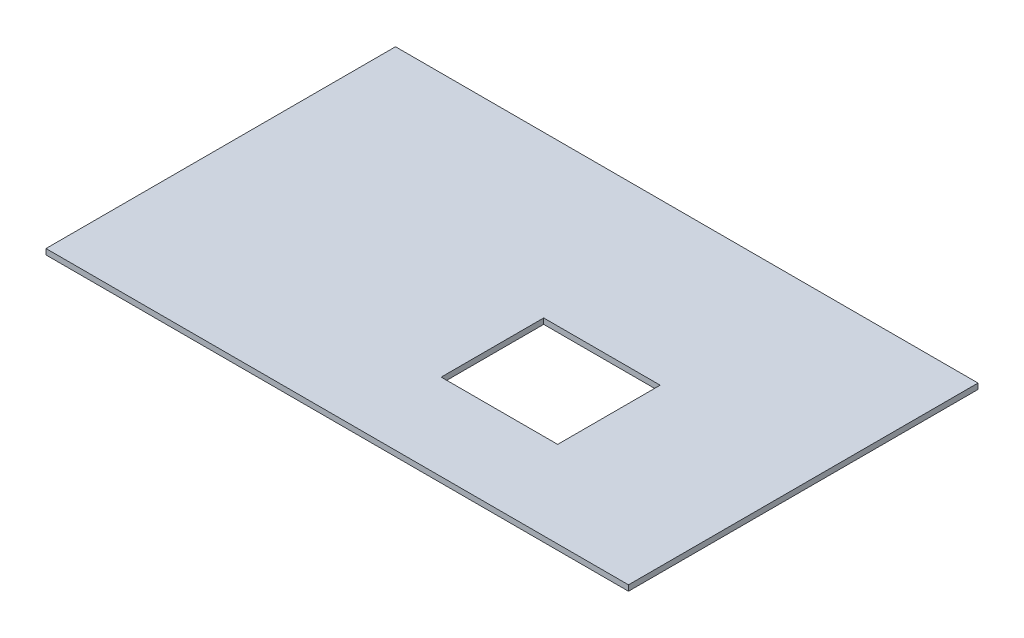
ISO-10303-21;
HEADER;
FILE_DESCRIPTION(('STEP AP214'),'2;1');
FILE_NAME('part.step','',(''),(''),'','','');
FILE_SCHEMA(('AUTOMOTIVE_DESIGN { 1 0 10303 214 1 1 1 1 }'));
ENDSEC;
DATA;
#1=APPLICATION_CONTEXT('core data for automotive mechanical design processes');
#2=APPLICATION_PROTOCOL_DEFINITION('international standard','automotive_design',2000,#1);
#3=PRODUCT_CONTEXT('',#1,'mechanical');
#4=PRODUCT('Part','Part','',(#3));
#5=PRODUCT_RELATED_PRODUCT_CATEGORY('part','',(#4));
#6=PRODUCT_DEFINITION_FORMATION('','',#4);
#7=PRODUCT_DEFINITION_CONTEXT('part definition',#1,'design');
#8=PRODUCT_DEFINITION('design','',#6,#7);
#9=PRODUCT_DEFINITION_SHAPE('','',#8);
#10=(LENGTH_UNIT() NAMED_UNIT(*) SI_UNIT(.MILLI.,.METRE.));
#11=(NAMED_UNIT(*) PLANE_ANGLE_UNIT() SI_UNIT($,.RADIAN.));
#12=(NAMED_UNIT(*) SI_UNIT($,.STERADIAN.) SOLID_ANGLE_UNIT());
#13=UNCERTAINTY_MEASURE_WITH_UNIT(LENGTH_MEASURE(1.E-05),#10,'distance_accuracy_value','');
#14=(GEOMETRIC_REPRESENTATION_CONTEXT(3) GLOBAL_UNCERTAINTY_ASSIGNED_CONTEXT((#13)) GLOBAL_UNIT_ASSIGNED_CONTEXT((#10,
#11,#12)) REPRESENTATION_CONTEXT('',''));
#15=CARTESIAN_POINT('',(0.,0.,0.));
#16=DIRECTION('',(0.,0.,1.));
#17=DIRECTION('',(1.,0.,0.));
#18=AXIS2_PLACEMENT_3D('',#15,#16,#17);
#19=CARTESIAN_POINT('',(0.,1.2,0.));
#20=DIRECTION('',(0.,1.,0.));
#21=DIRECTION('',(0.,0.,1.));
#22=AXIS2_PLACEMENT_3D('',#19,#20,#21);
#23=PLANE('',#22);
#24=DIRECTION('',(-1.,0.,0.));
#25=VECTOR('',#24,1.);
#26=CARTESIAN_POINT('',(25.8,1.2,-2.99999999999999));
#27=LINE('',#26,#25);
#28=CARTESIAN_POINT('',(28.8,1.2,-2.99999999999999));
#29=VERTEX_POINT('',#28);
#30=CARTESIAN_POINT('',(3.80000000000001,1.2,-2.99999999999999));
#31=VERTEX_POINT('',#30);
#32=EDGE_CURVE('E157',#29,#31,#27,.T.);
#33=ORIENTED_EDGE('',*,*,#32,.F.);
#34=DIRECTION('',(0.,0.,-1.));
#35=VECTOR('',#34,1.);
#36=CARTESIAN_POINT('',(28.8,1.2,0.));
#37=LINE('',#36,#35);
#38=CARTESIAN_POINT('',(28.8,1.2,19.));
#39=VERTEX_POINT('',#38);
#40=EDGE_CURVE('E148',#39,#29,#37,.T.);
#41=ORIENTED_EDGE('',*,*,#40,.F.);
#42=DIRECTION('',(1.,0.,0.));
#43=VECTOR('',#42,1.);
#44=CARTESIAN_POINT('',(25.8,1.2,19.));
#45=LINE('',#44,#43);
#46=CARTESIAN_POINT('',(3.80000000000001,1.2,19.));
#47=VERTEX_POINT('',#46);
#48=EDGE_CURVE('E134',#47,#39,#45,.T.);
#49=ORIENTED_EDGE('',*,*,#48,.F.);
#50=DIRECTION('',(0.,0.,1.));
#51=VECTOR('',#50,1.);
#52=CARTESIAN_POINT('',(3.80000000000001,1.2,19.));
#53=LINE('',#52,#51);
#54=EDGE_CURVE('E152',#31,#47,#53,.T.);
#55=ORIENTED_EDGE('',*,*,#54,.F.);
#56=EDGE_LOOP('',(#33,#41,#49,#55));
#57=FACE_BOUND('',#56,.T.);
#58=DIRECTION('',(0.,0.,1.));
#59=VECTOR('',#58,1.);
#60=CARTESIAN_POINT('',(-62.5,1.2,37.5));
#61=LINE('',#60,#59);
#62=CARTESIAN_POINT('',(-62.5,1.2,-37.5));
#63=VERTEX_POINT('',#62);
#64=CARTESIAN_POINT('',(-62.5,1.2,37.5));
#65=VERTEX_POINT('',#64);
#66=EDGE_CURVE('E171',#63,#65,#61,.T.);
#67=ORIENTED_EDGE('',*,*,#66,.T.);
#68=DIRECTION('',(1.,0.,0.));
#69=VECTOR('',#68,1.);
#70=CARTESIAN_POINT('',(62.5,1.2,37.5));
#71=LINE('',#70,#69);
#72=CARTESIAN_POINT('',(62.5,1.2,37.5));
#73=VERTEX_POINT('',#72);
#74=EDGE_CURVE('E96',#65,#73,#71,.T.);
#75=ORIENTED_EDGE('',*,*,#74,.T.);
#76=DIRECTION('',(0.,0.,-1.));
#77=VECTOR('',#76,1.);
#78=CARTESIAN_POINT('',(62.5,1.2,37.5));
#79=LINE('',#78,#77);
#80=CARTESIAN_POINT('',(62.5,1.2,-37.5));
#81=VERTEX_POINT('',#80);
#82=EDGE_CURVE('E176',#73,#81,#79,.T.);
#83=ORIENTED_EDGE('',*,*,#82,.T.);
#84=DIRECTION('',(-1.,0.,0.));
#85=VECTOR('',#84,1.);
#86=CARTESIAN_POINT('',(62.5,1.2,-37.5));
#87=LINE('',#86,#85);
#88=EDGE_CURVE('E68',#81,#63,#87,.T.);
#89=ORIENTED_EDGE('',*,*,#88,.T.);
#90=EDGE_LOOP('',(#67,#75,#83,#89));
#91=FACE_BOUND('',#90,.T.);
#92=ADVANCED_FACE('F43',(#57,#91),#23,.T.);
#93=CARTESIAN_POINT('',(0.,0.,0.));
#94=DIRECTION('',(0.,1.,0.));
#95=DIRECTION('',(0.,0.,1.));
#96=AXIS2_PLACEMENT_3D('',#93,#94,#95);
#97=PLANE('',#96);
#98=DIRECTION('',(0.,0.,1.));
#99=VECTOR('',#98,1.);
#100=CARTESIAN_POINT('',(-62.5,0.,37.5));
#101=LINE('',#100,#99);
#102=CARTESIAN_POINT('',(-62.5,0.,-37.5));
#103=VERTEX_POINT('',#102);
#104=CARTESIAN_POINT('',(-62.5,0.,37.5));
#105=VERTEX_POINT('',#104);
#106=EDGE_CURVE('E170',#103,#105,#101,.T.);
#107=ORIENTED_EDGE('',*,*,#106,.F.);
#108=DIRECTION('',(-1.,0.,0.));
#109=VECTOR('',#108,1.);
#110=CARTESIAN_POINT('',(62.5,0.,-37.5));
#111=LINE('',#110,#109);
#112=CARTESIAN_POINT('',(62.5,0.,-37.5));
#113=VERTEX_POINT('',#112);
#114=EDGE_CURVE('E89',#113,#103,#111,.T.);
#115=ORIENTED_EDGE('',*,*,#114,.F.);
#116=DIRECTION('',(0.,0.,-1.));
#117=VECTOR('',#116,1.);
#118=CARTESIAN_POINT('',(62.5,0.,37.5));
#119=LINE('',#118,#117);
#120=CARTESIAN_POINT('',(62.5,0.,37.5));
#121=VERTEX_POINT('',#120);
#122=EDGE_CURVE('E188',#121,#113,#119,.T.);
#123=ORIENTED_EDGE('',*,*,#122,.F.);
#124=DIRECTION('',(1.,0.,0.));
#125=VECTOR('',#124,1.);
#126=CARTESIAN_POINT('',(62.5,0.,37.5));
#127=LINE('',#126,#125);
#128=EDGE_CURVE('E185',#105,#121,#127,.T.);
#129=ORIENTED_EDGE('',*,*,#128,.F.);
#130=EDGE_LOOP('',(#107,#115,#123,#129));
#131=FACE_BOUND('',#130,.T.);
#132=DIRECTION('',(0.,0.,-1.));
#133=VECTOR('',#132,1.);
#134=CARTESIAN_POINT('',(28.8,0.,-2.99999999999999));
#135=LINE('',#134,#133);
#136=CARTESIAN_POINT('',(28.8,0.,19.));
#137=VERTEX_POINT('',#136);
#138=CARTESIAN_POINT('',(28.8,0.,-2.99999999999999));
#139=VERTEX_POINT('',#138);
#140=EDGE_CURVE('E124',#137,#139,#135,.T.);
#141=ORIENTED_EDGE('',*,*,#140,.T.);
#142=DIRECTION('',(-1.,0.,0.));
#143=VECTOR('',#142,1.);
#144=CARTESIAN_POINT('',(25.8,0.,-2.99999999999999));
#145=LINE('',#144,#143);
#146=CARTESIAN_POINT('',(3.80000000000001,0.,-2.99999999999999));
#147=VERTEX_POINT('',#146);
#148=EDGE_CURVE('E128',#139,#147,#145,.T.);
#149=ORIENTED_EDGE('',*,*,#148,.T.);
#150=DIRECTION('',(0.,0.,1.));
#151=VECTOR('',#150,1.);
#152=CARTESIAN_POINT('',(3.80000000000001,0.,19.));
#153=LINE('',#152,#151);
#154=CARTESIAN_POINT('',(3.80000000000001,0.,19.));
#155=VERTEX_POINT('',#154);
#156=EDGE_CURVE('E59',#147,#155,#153,.T.);
#157=ORIENTED_EDGE('',*,*,#156,.T.);
#158=DIRECTION('',(1.,0.,0.));
#159=VECTOR('',#158,1.);
#160=CARTESIAN_POINT('',(25.8,0.,19.));
#161=LINE('',#160,#159);
#162=EDGE_CURVE('E119',#155,#137,#161,.T.);
#163=ORIENTED_EDGE('',*,*,#162,.T.);
#164=EDGE_LOOP('',(#141,#149,#157,#163));
#165=FACE_BOUND('',#164,.T.);
#166=ADVANCED_FACE('F121',(#131,#165),#97,.F.);
#167=CARTESIAN_POINT('',(-62.5,1.2,37.5));
#168=DIRECTION('',(1.,0.,0.));
#169=DIRECTION('',(0.,0.,-1.));
#170=AXIS2_PLACEMENT_3D('',#167,#168,#169);
#171=PLANE('',#170);
#172=ORIENTED_EDGE('',*,*,#106,.T.);
#173=DIRECTION('',(0.,-1.,0.));
#174=VECTOR('',#173,1.);
#175=CARTESIAN_POINT('',(-62.5,1.2,37.5));
#176=LINE('',#175,#174);
#177=EDGE_CURVE('E11',#65,#105,#176,.T.);
#178=ORIENTED_EDGE('',*,*,#177,.F.);
#179=ORIENTED_EDGE('',*,*,#66,.F.);
#180=DIRECTION('',(0.,-1.,0.));
#181=VECTOR('',#180,1.);
#182=CARTESIAN_POINT('',(-62.5,1.2,-37.5));
#183=LINE('',#182,#181);
#184=EDGE_CURVE('E181',#63,#103,#183,.T.);
#185=ORIENTED_EDGE('',*,*,#184,.T.);
#186=EDGE_LOOP('',(#172,#178,#179,#185));
#187=FACE_BOUND('',#186,.T.);
#188=ADVANCED_FACE('F45',(#187),#171,.F.);
#189=CARTESIAN_POINT('',(62.5,1.2,37.5));
#190=DIRECTION('',(0.,0.,-1.));
#191=DIRECTION('',(-1.,0.,0.));
#192=AXIS2_PLACEMENT_3D('',#189,#190,#191);
#193=PLANE('',#192);
#194=ORIENTED_EDGE('',*,*,#128,.T.);
#195=DIRECTION('',(0.,-1.,0.));
#196=VECTOR('',#195,1.);
#197=CARTESIAN_POINT('',(62.5,1.2,37.5));
#198=LINE('',#197,#196);
#199=EDGE_CURVE('E52',#73,#121,#198,.T.);
#200=ORIENTED_EDGE('',*,*,#199,.F.);
#201=ORIENTED_EDGE('',*,*,#74,.F.);
#202=ORIENTED_EDGE('',*,*,#177,.T.);
#203=EDGE_LOOP('',(#194,#200,#201,#202));
#204=FACE_BOUND('',#203,.T.);
#205=ADVANCED_FACE('F218',(#204),#193,.F.);
#206=CARTESIAN_POINT('',(62.5,1.2,37.5));
#207=DIRECTION('',(-1.,0.,0.));
#208=DIRECTION('',(0.,0.,1.));
#209=AXIS2_PLACEMENT_3D('',#206,#207,#208);
#210=PLANE('',#209);
#211=ORIENTED_EDGE('',*,*,#122,.T.);
#212=DIRECTION('',(0.,-1.,0.));
#213=VECTOR('',#212,1.);
#214=CARTESIAN_POINT('',(62.5,1.2,-37.5));
#215=LINE('',#214,#213);
#216=EDGE_CURVE('E195',#81,#113,#215,.T.);
#217=ORIENTED_EDGE('',*,*,#216,.F.);
#218=ORIENTED_EDGE('',*,*,#82,.F.);
#219=ORIENTED_EDGE('',*,*,#199,.T.);
#220=EDGE_LOOP('',(#211,#217,#218,#219));
#221=FACE_BOUND('',#220,.T.);
#222=ADVANCED_FACE('F202',(#221),#210,.F.);
#223=CARTESIAN_POINT('',(62.5,1.2,-37.5));
#224=DIRECTION('',(0.,0.,1.));
#225=DIRECTION('',(1.,0.,0.));
#226=AXIS2_PLACEMENT_3D('',#223,#224,#225);
#227=PLANE('',#226);
#228=ORIENTED_EDGE('',*,*,#114,.T.);
#229=ORIENTED_EDGE('',*,*,#184,.F.);
#230=ORIENTED_EDGE('',*,*,#88,.F.);
#231=ORIENTED_EDGE('',*,*,#216,.T.);
#232=EDGE_LOOP('',(#228,#229,#230,#231));
#233=FACE_BOUND('',#232,.T.);
#234=ADVANCED_FACE('F209',(#233),#227,.F.);
#235=CARTESIAN_POINT('',(3.80000000000001,1.2,19.));
#236=DIRECTION('',(1.,0.,0.));
#237=DIRECTION('',(0.,0.,-1.));
#238=AXIS2_PLACEMENT_3D('',#235,#236,#237);
#239=PLANE('',#238);
#240=ORIENTED_EDGE('',*,*,#156,.F.);
#241=DIRECTION('',(0.,-1.,0.));
#242=VECTOR('',#241,1.);
#243=CARTESIAN_POINT('',(3.80000000000001,1.2,-2.99999999999999));
#244=LINE('',#243,#242);
#245=EDGE_CURVE('E160',#31,#147,#244,.T.);
#246=ORIENTED_EDGE('',*,*,#245,.F.);
#247=ORIENTED_EDGE('',*,*,#54,.T.);
#248=DIRECTION('',(0.,-1.,0.));
#249=VECTOR('',#248,1.);
#250=CARTESIAN_POINT('',(3.80000000000001,1.2,19.));
#251=LINE('',#250,#249);
#252=EDGE_CURVE('E167',#47,#155,#251,.T.);
#253=ORIENTED_EDGE('',*,*,#252,.T.);
#254=EDGE_LOOP('',(#240,#246,#247,#253));
#255=FACE_BOUND('',#254,.T.);
#256=ADVANCED_FACE('F211',(#255),#239,.T.);
#257=CARTESIAN_POINT('',(25.8,1.2,19.));
#258=DIRECTION('',(0.,0.,-1.));
#259=DIRECTION('',(-1.,0.,0.));
#260=AXIS2_PLACEMENT_3D('',#257,#258,#259);
#261=PLANE('',#260);
#262=ORIENTED_EDGE('',*,*,#162,.F.);
#263=ORIENTED_EDGE('',*,*,#252,.F.);
#264=ORIENTED_EDGE('',*,*,#48,.T.);
#265=DIRECTION('',(0.,1.,0.));
#266=VECTOR('',#265,1.);
#267=CARTESIAN_POINT('',(28.8,0.,19.));
#268=LINE('',#267,#266);
#269=EDGE_CURVE('E131',#137,#39,#268,.T.);
#270=ORIENTED_EDGE('',*,*,#269,.F.);
#271=EDGE_LOOP('',(#262,#263,#264,#270));
#272=FACE_BOUND('',#271,.T.);
#273=ADVANCED_FACE('F132',(#272),#261,.T.);
#274=CARTESIAN_POINT('',(25.8,1.2,-2.99999999999999));
#275=DIRECTION('',(0.,0.,1.));
#276=DIRECTION('',(1.,0.,0.));
#277=AXIS2_PLACEMENT_3D('',#274,#275,#276);
#278=PLANE('',#277);
#279=ORIENTED_EDGE('',*,*,#148,.F.);
#280=DIRECTION('',(0.,1.,0.));
#281=VECTOR('',#280,1.);
#282=CARTESIAN_POINT('',(28.8,0.,-2.99999999999999));
#283=LINE('',#282,#281);
#284=EDGE_CURVE('E139',#139,#29,#283,.T.);
#285=ORIENTED_EDGE('',*,*,#284,.T.);
#286=ORIENTED_EDGE('',*,*,#32,.T.);
#287=ORIENTED_EDGE('',*,*,#245,.T.);
#288=EDGE_LOOP('',(#279,#285,#286,#287));
#289=FACE_BOUND('',#288,.T.);
#290=ADVANCED_FACE('F230',(#289),#278,.T.);
#291=CARTESIAN_POINT('',(28.8,0.,-2.99999999999999));
#292=DIRECTION('',(1.,0.,0.));
#293=DIRECTION('',(0.,0.,-1.));
#294=AXIS2_PLACEMENT_3D('',#291,#292,#293);
#295=PLANE('',#294);
#296=ORIENTED_EDGE('',*,*,#40,.T.);
#297=ORIENTED_EDGE('',*,*,#284,.F.);
#298=ORIENTED_EDGE('',*,*,#140,.F.);
#299=ORIENTED_EDGE('',*,*,#269,.T.);
#300=EDGE_LOOP('',(#296,#297,#298,#299));
#301=FACE_BOUND('',#300,.T.);
#302=ADVANCED_FACE('F142',(#301),#295,.F.);
#303=CLOSED_SHELL('',(#92,#166,#188,#205,#222,#234,#256,#273,#290,#302));
#304=MANIFOLD_SOLID_BREP('B2',#303);
#305=ADVANCED_BREP_SHAPE_REPRESENTATION('',(#18,#304),#14);
#306=SHAPE_DEFINITION_REPRESENTATION(#9,#305);
ENDSEC;
END-ISO-10303-21;
